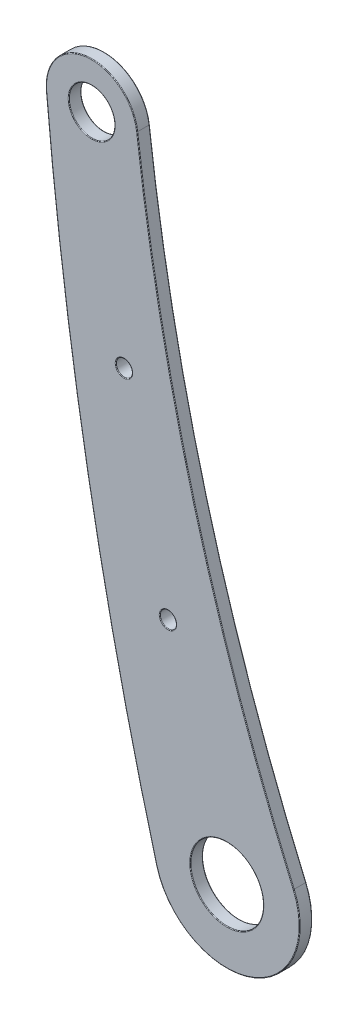
ISO-10303-21;
HEADER;
FILE_DESCRIPTION(('STEP AP214'),'2;1');
FILE_NAME('part.step','',(''),(''),'','','');
FILE_SCHEMA(('AUTOMOTIVE_DESIGN { 1 0 10303 214 1 1 1 1 }'));
ENDSEC;
DATA;
#1=APPLICATION_CONTEXT('core data for automotive mechanical design processes');
#2=APPLICATION_PROTOCOL_DEFINITION('international standard','automotive_design',2000,#1);
#3=PRODUCT_CONTEXT('',#1,'mechanical');
#4=PRODUCT('Part','Part','',(#3));
#5=PRODUCT_RELATED_PRODUCT_CATEGORY('part','',(#4));
#6=PRODUCT_DEFINITION_FORMATION('','',#4);
#7=PRODUCT_DEFINITION_CONTEXT('part definition',#1,'design');
#8=PRODUCT_DEFINITION('design','',#6,#7);
#9=PRODUCT_DEFINITION_SHAPE('','',#8);
#10=(LENGTH_UNIT() NAMED_UNIT(*) SI_UNIT(.MILLI.,.METRE.));
#11=(NAMED_UNIT(*) PLANE_ANGLE_UNIT() SI_UNIT($,.RADIAN.));
#12=(NAMED_UNIT(*) SI_UNIT($,.STERADIAN.) SOLID_ANGLE_UNIT());
#13=UNCERTAINTY_MEASURE_WITH_UNIT(LENGTH_MEASURE(1.E-05),#10,'distance_accuracy_value','');
#14=(GEOMETRIC_REPRESENTATION_CONTEXT(3) GLOBAL_UNCERTAINTY_ASSIGNED_CONTEXT((#13)) GLOBAL_UNIT_ASSIGNED_CONTEXT((#10,
#11,#12)) REPRESENTATION_CONTEXT('',''));
#15=CARTESIAN_POINT('',(0.,0.,0.));
#16=DIRECTION('',(0.,0.,1.));
#17=DIRECTION('',(1.,0.,0.));
#18=AXIS2_PLACEMENT_3D('',#15,#16,#17);
#19=CARTESIAN_POINT('',(200.988007180128,232.62825780166,3.));
#20=DIRECTION('',(0.,0.,-1.));
#21=DIRECTION('',(-1.,0.,0.));
#22=AXIS2_PLACEMENT_3D('',#19,#20,#21);
#23=PLANE('',#22);
#24=CARTESIAN_POINT('',(-34.3508040044645,105.541655290319,3.));
#25=DIRECTION('',(0.,0.,-1.));
#26=DIRECTION('',(-1.,0.,0.));
#27=AXIS2_PLACEMENT_3D('',#24,#25,#26);
#28=CIRCLE('',#27,2.09999999999999);
#29=CARTESIAN_POINT('',(-36.4508040044645,105.541655290319,3.));
#30=VERTEX_POINT('',#29);
#31=EDGE_CURVE('E11',#30,#30,#28,.T.);
#32=ORIENTED_EDGE('',*,*,#31,.T.);
#33=EDGE_LOOP('',(#32));
#34=FACE_BOUND('',#33,.T.);
#35=CARTESIAN_POINT('',(-20.22,57.58,3.));
#36=DIRECTION('',(0.,0.,-1.));
#37=DIRECTION('',(-1.,0.,0.));
#38=AXIS2_PLACEMENT_3D('',#35,#36,#37);
#39=CIRCLE('',#38,8.9);
#40=CARTESIAN_POINT('',(-29.12,57.58,3.));
#41=VERTEX_POINT('',#40);
#42=EDGE_CURVE('E42',#41,#41,#39,.T.);
#43=ORIENTED_EDGE('',*,*,#42,.T.);
#44=EDGE_LOOP('',(#43));
#45=FACE_BOUND('',#44,.T.);
#46=CARTESIAN_POINT('',(-52.6670691041316,201.979403414805,3.));
#47=DIRECTION('',(0.,0.,-1.));
#48=DIRECTION('',(-1.,0.,0.));
#49=AXIS2_PLACEMENT_3D('',#46,#47,#48);
#50=CIRCLE('',#49,5.65);
#51=CARTESIAN_POINT('',(-58.3170691041316,201.979403414805,3.));
#52=VERTEX_POINT('',#51);
#53=EDGE_CURVE('E187',#52,#52,#50,.T.);
#54=ORIENTED_EDGE('',*,*,#53,.T.);
#55=EDGE_LOOP('',(#54));
#56=FACE_BOUND('',#55,.T.);
#57=CARTESIAN_POINT('',(-20.22,57.58,3.));
#58=DIRECTION('',(0.,0.,-1.));
#59=DIRECTION('',(-1.,0.,0.));
#60=AXIS2_PLACEMENT_3D('',#57,#58,#59);
#61=CIRCLE('',#60,17.3500000000001);
#62=CARTESIAN_POINT('',(-36.960505291953,53.0217127591489,3.));
#63=VERTEX_POINT('',#62);
#64=CARTESIAN_POINT('',(-4.29946956887513,64.4763186405233,3.));
#65=VERTEX_POINT('',#64);
#66=EDGE_CURVE('E50',#63,#65,#61,.F.);
#67=ORIENTED_EDGE('',*,*,#66,.T.);
#68=CARTESIAN_POINT('',(454.643083464387,263.277112188516,3.));
#69=DIRECTION('',(0.,0.,-1.));
#70=DIRECTION('',(-1.,0.,0.));
#71=AXIS2_PLACEMENT_3D('',#68,#69,#70);
#72=CIRCLE('',#71,500.15);
#73=CARTESIAN_POINT('',(-41.8954151797315,203.280930107946,3.));
#74=VERTEX_POINT('',#73);
#75=EDGE_CURVE('E185',#65,#74,#72,.T.);
#76=ORIENTED_EDGE('',*,*,#75,.T.);
#77=CARTESIAN_POINT('',(-52.6670691041316,201.979403414805,3.));
#78=DIRECTION('',(0.,0.,-1.));
#79=DIRECTION('',(-1.,0.,0.));
#80=AXIS2_PLACEMENT_3D('',#77,#78,#79);
#81=CIRCLE('',#80,10.85);
#82=CARTESIAN_POINT('',(-63.4744173782128,201.018298174619,3.));
#83=VERTEX_POINT('',#82);
#84=EDGE_CURVE('E181',#74,#83,#81,.F.);
#85=ORIENTED_EDGE('',*,*,#84,.T.);
#86=CARTESIAN_POINT('',(783.034792827124,276.29896991403,3.));
#87=DIRECTION('',(0.,0.,-1.));
#88=DIRECTION('',(-1.,0.,0.));
#89=AXIS2_PLACEMENT_3D('',#86,#87,#88);
#90=CIRCLE('',#89,849.85);
#91=EDGE_CURVE('E55',#83,#63,#90,.F.);
#92=ORIENTED_EDGE('',*,*,#91,.T.);
#93=EDGE_LOOP('',(#67,#76,#85,#92));
#94=FACE_BOUND('',#93,.T.);
#95=CARTESIAN_POINT('',(-44.9211727354749,152.583036246298,3.));
#96=DIRECTION('',(0.,0.,-1.));
#97=DIRECTION('',(-1.,0.,0.));
#98=AXIS2_PLACEMENT_3D('',#95,#96,#97);
#99=CIRCLE('',#98,2.09999999999999);
#100=CARTESIAN_POINT('',(-47.0211727354749,152.583036246298,3.));
#101=VERTEX_POINT('',#100);
#102=EDGE_CURVE('E178',#101,#101,#99,.T.);
#103=ORIENTED_EDGE('',*,*,#102,.T.);
#104=EDGE_LOOP('',(#103));
#105=FACE_BOUND('',#104,.T.);
#106=ADVANCED_FACE('F33',(#34,#45,#56,#94,#105),#23,.F.);
#107=CARTESIAN_POINT('',(200.988007180128,232.62825780166,0.));
#108=DIRECTION('',(0.,0.,-1.));
#109=DIRECTION('',(-1.,0.,0.));
#110=AXIS2_PLACEMENT_3D('',#107,#108,#109);
#111=PLANE('',#110);
#112=CARTESIAN_POINT('',(-34.3508040044645,105.541655290319,0.));
#113=DIRECTION('',(0.,0.,-1.));
#114=DIRECTION('',(-1.,0.,0.));
#115=AXIS2_PLACEMENT_3D('',#112,#113,#114);
#116=CIRCLE('',#115,2.09999999999999);
#117=CARTESIAN_POINT('',(-36.4508040044645,105.541655290319,0.));
#118=VERTEX_POINT('',#117);
#119=EDGE_CURVE('E131',#118,#118,#116,.F.);
#120=ORIENTED_EDGE('',*,*,#119,.T.);
#121=EDGE_LOOP('',(#120));
#122=FACE_BOUND('',#121,.T.);
#123=CARTESIAN_POINT('',(-52.6670691041316,201.979403414805,0.));
#124=DIRECTION('',(0.,0.,-1.));
#125=DIRECTION('',(-1.,0.,0.));
#126=AXIS2_PLACEMENT_3D('',#123,#124,#125);
#127=CIRCLE('',#126,5.65);
#128=CARTESIAN_POINT('',(-58.3170691041316,201.979403414805,0.));
#129=VERTEX_POINT('',#128);
#130=EDGE_CURVE('E128',#129,#129,#127,.F.);
#131=ORIENTED_EDGE('',*,*,#130,.T.);
#132=EDGE_LOOP('',(#131));
#133=FACE_BOUND('',#132,.T.);
#134=CARTESIAN_POINT('',(-20.22,57.58,0.));
#135=DIRECTION('',(0.,0.,-1.));
#136=DIRECTION('',(-1.,0.,0.));
#137=AXIS2_PLACEMENT_3D('',#134,#135,#136);
#138=CIRCLE('',#137,17.3500000000001);
#139=CARTESIAN_POINT('',(-4.29946956887523,64.4763186405233,0.));
#140=VERTEX_POINT('',#139);
#141=CARTESIAN_POINT('',(-36.9605052919527,53.021712759149,0.));
#142=VERTEX_POINT('',#141);
#143=EDGE_CURVE('E127',#140,#142,#138,.T.);
#144=ORIENTED_EDGE('',*,*,#143,.T.);
#145=CARTESIAN_POINT('',(783.034792827124,276.29896991403,0.));
#146=DIRECTION('',(0.,0.,-1.));
#147=DIRECTION('',(-1.,0.,0.));
#148=AXIS2_PLACEMENT_3D('',#145,#146,#147);
#149=CIRCLE('',#148,849.85);
#150=CARTESIAN_POINT('',(-63.4744173782128,201.018298174619,0.));
#151=VERTEX_POINT('',#150);
#152=EDGE_CURVE('E105',#142,#151,#149,.T.);
#153=ORIENTED_EDGE('',*,*,#152,.T.);
#154=CARTESIAN_POINT('',(-52.6670691041316,201.979403414805,0.));
#155=DIRECTION('',(0.,0.,-1.));
#156=DIRECTION('',(-1.,0.,0.));
#157=AXIS2_PLACEMENT_3D('',#154,#155,#156);
#158=CIRCLE('',#157,10.85);
#159=CARTESIAN_POINT('',(-41.8954151797315,203.280930107946,0.));
#160=VERTEX_POINT('',#159);
#161=EDGE_CURVE('E115',#151,#160,#158,.T.);
#162=ORIENTED_EDGE('',*,*,#161,.T.);
#163=CARTESIAN_POINT('',(454.643083464387,263.277112188516,0.));
#164=DIRECTION('',(0.,0.,-1.));
#165=DIRECTION('',(-1.,0.,0.));
#166=AXIS2_PLACEMENT_3D('',#163,#164,#165);
#167=CIRCLE('',#166,500.15);
#168=EDGE_CURVE('E121',#160,#140,#167,.F.);
#169=ORIENTED_EDGE('',*,*,#168,.T.);
#170=EDGE_LOOP('',(#144,#153,#162,#169));
#171=FACE_BOUND('',#170,.T.);
#172=CARTESIAN_POINT('',(-20.22,57.58,0.));
#173=DIRECTION('',(0.,0.,-1.));
#174=DIRECTION('',(-1.,0.,0.));
#175=AXIS2_PLACEMENT_3D('',#172,#173,#174);
#176=CIRCLE('',#175,8.9);
#177=CARTESIAN_POINT('',(-29.12,57.58,0.));
#178=VERTEX_POINT('',#177);
#179=EDGE_CURVE('E122',#178,#178,#176,.F.);
#180=ORIENTED_EDGE('',*,*,#179,.T.);
#181=EDGE_LOOP('',(#180));
#182=FACE_BOUND('',#181,.T.);
#183=CARTESIAN_POINT('',(-44.9211727354749,152.583036246298,0.));
#184=DIRECTION('',(0.,0.,-1.));
#185=DIRECTION('',(-1.,0.,0.));
#186=AXIS2_PLACEMENT_3D('',#183,#184,#185);
#187=CIRCLE('',#186,2.09999999999999);
#188=CARTESIAN_POINT('',(-47.0211727354749,152.583036246298,0.));
#189=VERTEX_POINT('',#188);
#190=EDGE_CURVE('E225',#189,#189,#187,.F.);
#191=ORIENTED_EDGE('',*,*,#190,.T.);
#192=EDGE_LOOP('',(#191));
#193=FACE_BOUND('',#192,.T.);
#194=ADVANCED_FACE('F124',(#122,#133,#171,#182,#193),#111,.T.);
#195=CARTESIAN_POINT('',(-52.6670691041316,201.979403414805,3.));
#196=DIRECTION('',(0.,0.,-1.));
#197=DIRECTION('',(-1.,0.,0.));
#198=AXIS2_PLACEMENT_3D('',#195,#196,#197);
#199=CYLINDRICAL_SURFACE('',#198,11.);
#200=DIRECTION('',(0.,0.,-1.));
#201=VECTOR('',#200,1.);
#202=CARTESIAN_POINT('',(-41.7464983052007,203.298923564533,3.));
#203=LINE('',#202,#201);
#204=CARTESIAN_POINT('',(-41.7464983052007,203.298923564533,2.85));
#205=VERTEX_POINT('',#204);
#206=CARTESIAN_POINT('',(-41.7464983052007,203.298923564533,0.15));
#207=VERTEX_POINT('',#206);
#208=EDGE_CURVE('E196',#205,#207,#203,.T.);
#209=ORIENTED_EDGE('',*,*,#208,.T.);
#210=CARTESIAN_POINT('',(-52.6670691041316,201.979403414805,0.15));
#211=DIRECTION('',(0.,0.,-1.));
#212=DIRECTION('',(-1.,0.,0.));
#213=AXIS2_PLACEMENT_3D('',#210,#211,#212);
#214=CIRCLE('',#213,11.);
#215=CARTESIAN_POINT('',(-63.623827723016,201.0050110054,0.15));
#216=VERTEX_POINT('',#215);
#217=EDGE_CURVE('E164',#207,#216,#214,.F.);
#218=ORIENTED_EDGE('',*,*,#217,.T.);
#219=DIRECTION('',(0.,0.,-1.));
#220=VECTOR('',#219,1.);
#221=CARTESIAN_POINT('',(-63.623827723016,201.0050110054,3.));
#222=LINE('',#221,#220);
#223=CARTESIAN_POINT('',(-63.623827723016,201.0050110054,2.85));
#224=VERTEX_POINT('',#223);
#225=EDGE_CURVE('E218',#224,#216,#222,.T.);
#226=ORIENTED_EDGE('',*,*,#225,.F.);
#227=CARTESIAN_POINT('',(-52.6670691041316,201.979403414805,2.85));
#228=DIRECTION('',(0.,0.,-1.));
#229=DIRECTION('',(-1.,0.,0.));
#230=AXIS2_PLACEMENT_3D('',#227,#228,#229);
#231=CIRCLE('',#230,11.);
#232=EDGE_CURVE('E162',#224,#205,#231,.T.);
#233=ORIENTED_EDGE('',*,*,#232,.T.);
#234=EDGE_LOOP('',(#209,#218,#226,#233));
#235=FACE_BOUND('',#234,.T.);
#236=ADVANCED_FACE('F223',(#235),#199,.T.);
#237=CARTESIAN_POINT('',(783.034792827124,276.29896991403,3.));
#238=DIRECTION('',(0.,0.,-1.));
#239=DIRECTION('',(-1.,0.,0.));
#240=AXIS2_PLACEMENT_3D('',#237,#238,#239);
#241=CYLINDRICAL_SURFACE('',#240,850.);
#242=ORIENTED_EDGE('',*,*,#225,.T.);
#243=CARTESIAN_POINT('',(783.034792827124,276.29896991403,0.15));
#244=DIRECTION('',(0.,0.,-1.));
#245=DIRECTION('',(-1.,0.,0.));
#246=AXIS2_PLACEMENT_3D('',#243,#244,#245);
#247=CIRCLE('',#246,850.);
#248=CARTESIAN_POINT('',(-37.1052358852549,52.9823039357411,0.15));
#249=VERTEX_POINT('',#248);
#250=EDGE_CURVE('E108',#216,#249,#247,.F.);
#251=ORIENTED_EDGE('',*,*,#250,.T.);
#252=DIRECTION('',(0.,0.,-1.));
#253=VECTOR('',#252,1.);
#254=CARTESIAN_POINT('',(-37.1052358852549,52.9823039357411,3.));
#255=LINE('',#254,#253);
#256=CARTESIAN_POINT('',(-37.1052358852549,52.9823039357411,2.85));
#257=VERTEX_POINT('',#256);
#258=EDGE_CURVE('E220',#257,#249,#255,.T.);
#259=ORIENTED_EDGE('',*,*,#258,.F.);
#260=CARTESIAN_POINT('',(783.034792827124,276.29896991403,2.85));
#261=DIRECTION('',(0.,0.,-1.));
#262=DIRECTION('',(-1.,0.,0.));
#263=AXIS2_PLACEMENT_3D('',#260,#261,#262);
#264=CIRCLE('',#263,850.);
#265=EDGE_CURVE('E150',#257,#224,#264,.T.);
#266=ORIENTED_EDGE('',*,*,#265,.T.);
#267=EDGE_LOOP('',(#242,#251,#259,#266));
#268=FACE_BOUND('',#267,.T.);
#269=ADVANCED_FACE('F217',(#268),#241,.T.);
#270=CARTESIAN_POINT('',(-20.22,57.58,3.));
#271=DIRECTION('',(0.,0.,-1.));
#272=DIRECTION('',(-1.,0.,0.));
#273=AXIS2_PLACEMENT_3D('',#270,#271,#272);
#274=CYLINDRICAL_SURFACE('',#273,17.5000000000001);
#275=ORIENTED_EDGE('',*,*,#258,.T.);
#276=CARTESIAN_POINT('',(-20.22,57.58,0.15));
#277=DIRECTION('',(0.,0.,-1.));
#278=DIRECTION('',(-1.,0.,0.));
#279=AXIS2_PLACEMENT_3D('',#276,#277,#278);
#280=CIRCLE('',#279,17.5000000000001);
#281=CARTESIAN_POINT('',(-4.16182809540733,64.5359409918823,0.15));
#282=VERTEX_POINT('',#281);
#283=EDGE_CURVE('E155',#249,#282,#280,.F.);
#284=ORIENTED_EDGE('',*,*,#283,.T.);
#285=DIRECTION('',(0.,0.,-1.));
#286=VECTOR('',#285,1.);
#287=CARTESIAN_POINT('',(-4.16182809540733,64.5359409918823,3.));
#288=LINE('',#287,#286);
#289=CARTESIAN_POINT('',(-4.16182809540733,64.5359409918823,2.85));
#290=VERTEX_POINT('',#289);
#291=EDGE_CURVE('E229',#290,#282,#288,.T.);
#292=ORIENTED_EDGE('',*,*,#291,.F.);
#293=CARTESIAN_POINT('',(-20.22,57.58,2.85));
#294=DIRECTION('',(0.,0.,-1.));
#295=DIRECTION('',(-1.,0.,0.));
#296=AXIS2_PLACEMENT_3D('',#293,#294,#295);
#297=CIRCLE('',#296,17.5000000000001);
#298=EDGE_CURVE('E153',#290,#257,#297,.T.);
#299=ORIENTED_EDGE('',*,*,#298,.T.);
#300=EDGE_LOOP('',(#275,#284,#292,#299));
#301=FACE_BOUND('',#300,.T.);
#302=ADVANCED_FACE('F244',(#301),#274,.T.);
#303=CARTESIAN_POINT('',(454.643083464387,263.277112188516,3.));
#304=DIRECTION('',(0.,0.,-1.));
#305=DIRECTION('',(-1.,0.,0.));
#306=AXIS2_PLACEMENT_3D('',#303,#304,#305);
#307=CYLINDRICAL_SURFACE('',#306,500.);
#308=ORIENTED_EDGE('',*,*,#291,.T.);
#309=CARTESIAN_POINT('',(454.643083464387,263.277112188516,0.15));
#310=DIRECTION('',(0.,0.,-1.));
#311=DIRECTION('',(-1.,0.,0.));
#312=AXIS2_PLACEMENT_3D('',#309,#310,#311);
#313=CIRCLE('',#312,500.);
#314=EDGE_CURVE('E160',#282,#207,#313,.T.);
#315=ORIENTED_EDGE('',*,*,#314,.T.);
#316=ORIENTED_EDGE('',*,*,#208,.F.);
#317=CARTESIAN_POINT('',(454.643083464387,263.277112188516,2.85));
#318=DIRECTION('',(0.,0.,-1.));
#319=DIRECTION('',(-1.,0.,0.));
#320=AXIS2_PLACEMENT_3D('',#317,#318,#319);
#321=CIRCLE('',#320,500.);
#322=EDGE_CURVE('E157',#205,#290,#321,.F.);
#323=ORIENTED_EDGE('',*,*,#322,.T.);
#324=EDGE_LOOP('',(#308,#315,#316,#323));
#325=FACE_BOUND('',#324,.T.);
#326=ADVANCED_FACE('F248',(#325),#307,.F.);
#327=CARTESIAN_POINT('',(-52.6670691041316,201.979403414805,3.));
#328=DIRECTION('',(0.,0.,-1.));
#329=DIRECTION('',(-1.,0.,0.));
#330=AXIS2_PLACEMENT_3D('',#327,#328,#329);
#331=CYLINDRICAL_SURFACE('',#330,5.5);
#332=CARTESIAN_POINT('',(-52.6670691041316,201.979403414805,0.15));
#333=DIRECTION('',(0.,0.,-1.));
#334=DIRECTION('',(-1.,0.,0.));
#335=AXIS2_PLACEMENT_3D('',#332,#333,#334);
#336=CIRCLE('',#335,5.5);
#337=CARTESIAN_POINT('',(-58.1670691041316,201.979403414805,0.15));
#338=VERTEX_POINT('',#337);
#339=EDGE_CURVE('E147',#338,#338,#336,.T.);
#340=ORIENTED_EDGE('',*,*,#339,.T.);
#341=EDGE_LOOP('',(#340));
#342=FACE_BOUND('',#341,.T.);
#343=CARTESIAN_POINT('',(-52.6670691041316,201.979403414805,2.85));
#344=DIRECTION('',(0.,0.,-1.));
#345=DIRECTION('',(-1.,0.,0.));
#346=AXIS2_PLACEMENT_3D('',#343,#344,#345);
#347=CIRCLE('',#346,5.5);
#348=CARTESIAN_POINT('',(-58.1670691041316,201.979403414805,2.85));
#349=VERTEX_POINT('',#348);
#350=EDGE_CURVE('E144',#349,#349,#347,.F.);
#351=ORIENTED_EDGE('',*,*,#350,.T.);
#352=EDGE_LOOP('',(#351));
#353=FACE_BOUND('',#352,.T.);
#354=ADVANCED_FACE('F283',(#342,#353),#331,.F.);
#355=CARTESIAN_POINT('',(-20.22,57.58,3.));
#356=DIRECTION('',(0.,0.,-1.));
#357=DIRECTION('',(-1.,0.,0.));
#358=AXIS2_PLACEMENT_3D('',#355,#356,#357);
#359=CYLINDRICAL_SURFACE('',#358,8.75);
#360=CARTESIAN_POINT('',(-20.22,57.58,0.15));
#361=DIRECTION('',(0.,0.,-1.));
#362=DIRECTION('',(-1.,0.,0.));
#363=AXIS2_PLACEMENT_3D('',#360,#361,#362);
#364=CIRCLE('',#363,8.75);
#365=CARTESIAN_POINT('',(-28.97,57.58,0.15));
#366=VERTEX_POINT('',#365);
#367=EDGE_CURVE('E169',#366,#366,#364,.T.);
#368=ORIENTED_EDGE('',*,*,#367,.T.);
#369=EDGE_LOOP('',(#368));
#370=FACE_BOUND('',#369,.T.);
#371=CARTESIAN_POINT('',(-20.22,57.58,2.85));
#372=DIRECTION('',(0.,0.,-1.));
#373=DIRECTION('',(-1.,0.,0.));
#374=AXIS2_PLACEMENT_3D('',#371,#372,#373);
#375=CIRCLE('',#374,8.75);
#376=CARTESIAN_POINT('',(-28.97,57.58,2.85));
#377=VERTEX_POINT('',#376);
#378=EDGE_CURVE('E166',#377,#377,#375,.F.);
#379=ORIENTED_EDGE('',*,*,#378,.T.);
#380=EDGE_LOOP('',(#379));
#381=FACE_BOUND('',#380,.T.);
#382=ADVANCED_FACE('F277',(#370,#381),#359,.F.);
#383=CARTESIAN_POINT('',(-34.3508040044645,105.541655290319,3.));
#384=DIRECTION('',(0.,0.,1.));
#385=DIRECTION('',(1.,0.,0.));
#386=AXIS2_PLACEMENT_3D('',#383,#384,#385);
#387=CYLINDRICAL_SURFACE('',#386,1.94999999999999);
#388=CARTESIAN_POINT('',(-34.3508040044645,105.541655290319,0.15));
#389=DIRECTION('',(0.,0.,-1.));
#390=DIRECTION('',(-1.,0.,0.));
#391=AXIS2_PLACEMENT_3D('',#388,#389,#390);
#392=CIRCLE('',#391,1.94999999999999);
#393=CARTESIAN_POINT('',(-36.3008040044645,105.541655290319,0.15));
#394=VERTEX_POINT('',#393);
#395=EDGE_CURVE('E141',#394,#394,#392,.T.);
#396=ORIENTED_EDGE('',*,*,#395,.T.);
#397=EDGE_LOOP('',(#396));
#398=FACE_BOUND('',#397,.T.);
#399=CARTESIAN_POINT('',(-34.3508040044645,105.541655290319,2.85));
#400=DIRECTION('',(0.,0.,-1.));
#401=DIRECTION('',(-1.,0.,0.));
#402=AXIS2_PLACEMENT_3D('',#399,#400,#401);
#403=CIRCLE('',#402,1.94999999999999);
#404=CARTESIAN_POINT('',(-36.3008040044645,105.541655290319,2.85));
#405=VERTEX_POINT('',#404);
#406=EDGE_CURVE('E138',#405,#405,#403,.F.);
#407=ORIENTED_EDGE('',*,*,#406,.T.);
#408=EDGE_LOOP('',(#407));
#409=FACE_BOUND('',#408,.T.);
#410=ADVANCED_FACE('F267',(#398,#409),#387,.F.);
#411=CARTESIAN_POINT('',(-44.9211727354749,152.583036246298,3.));
#412=DIRECTION('',(0.,0.,1.));
#413=DIRECTION('',(1.,0.,0.));
#414=AXIS2_PLACEMENT_3D('',#411,#412,#413);
#415=CYLINDRICAL_SURFACE('',#414,1.94999999999999);
#416=CARTESIAN_POINT('',(-44.9211727354749,152.583036246298,0.15));
#417=DIRECTION('',(0.,0.,-1.));
#418=DIRECTION('',(-1.,0.,0.));
#419=AXIS2_PLACEMENT_3D('',#416,#417,#418);
#420=CIRCLE('',#419,1.94999999999999);
#421=CARTESIAN_POINT('',(-46.8711727354749,152.583036246298,0.15));
#422=VERTEX_POINT('',#421);
#423=EDGE_CURVE('E175',#422,#422,#420,.T.);
#424=ORIENTED_EDGE('',*,*,#423,.T.);
#425=EDGE_LOOP('',(#424));
#426=FACE_BOUND('',#425,.T.);
#427=CARTESIAN_POINT('',(-44.9211727354749,152.583036246298,2.85));
#428=DIRECTION('',(0.,0.,-1.));
#429=DIRECTION('',(-1.,0.,0.));
#430=AXIS2_PLACEMENT_3D('',#427,#428,#429);
#431=CIRCLE('',#430,1.94999999999999);
#432=CARTESIAN_POINT('',(-46.8711727354749,152.583036246298,2.85));
#433=VERTEX_POINT('',#432);
#434=EDGE_CURVE('E172',#433,#433,#431,.F.);
#435=ORIENTED_EDGE('',*,*,#434,.T.);
#436=EDGE_LOOP('',(#435));
#437=FACE_BOUND('',#436,.T.);
#438=ADVANCED_FACE('F264',(#426,#437),#415,.F.);
#439=CARTESIAN_POINT('',(-34.3508040044645,105.541655290319,0.15));
#440=DIRECTION('',(0.,0.,-1.));
#441=DIRECTION('',(-1.,0.,0.));
#442=AXIS2_PLACEMENT_3D('',#439,#440,#441);
#443=TOROIDAL_SURFACE('',#442,2.09999999999999,0.15);
#444=ORIENTED_EDGE('',*,*,#395,.F.);
#445=EDGE_LOOP('',(#444));
#446=FACE_BOUND('',#445,.T.);
#447=ORIENTED_EDGE('',*,*,#119,.F.);
#448=EDGE_LOOP('',(#447));
#449=FACE_BOUND('',#448,.T.);
#450=ADVANCED_FACE('F266',(#446,#449),#443,.T.);
#451=CARTESIAN_POINT('',(-52.6670691041316,201.979403414805,0.15));
#452=DIRECTION('',(0.,0.,-1.));
#453=DIRECTION('',(-1.,0.,0.));
#454=AXIS2_PLACEMENT_3D('',#451,#452,#453);
#455=TOROIDAL_SURFACE('',#454,5.65,0.15);
#456=ORIENTED_EDGE('',*,*,#339,.F.);
#457=EDGE_LOOP('',(#456));
#458=FACE_BOUND('',#457,.T.);
#459=ORIENTED_EDGE('',*,*,#130,.F.);
#460=EDGE_LOOP('',(#459));
#461=FACE_BOUND('',#460,.T.);
#462=ADVANCED_FACE('F274',(#458,#461),#455,.T.);
#463=CARTESIAN_POINT('',(454.643083464387,263.277112188516,0.15));
#464=DIRECTION('',(0.,0.,-1.));
#465=DIRECTION('',(-1.,0.,0.));
#466=AXIS2_PLACEMENT_3D('',#463,#464,#465);
#467=TOROIDAL_SURFACE('',#466,500.15,0.15);
#468=CARTESIAN_POINT('',(-4.29946956887523,64.4763186405233,0.15));
#469=DIRECTION('',(0.397482342393292,-0.917609823119577,0.));
#470=DIRECTION('',(0.917609823119577,0.397482342393292,0.));
#471=AXIS2_PLACEMENT_3D('',#468,#469,#470);
#472=CIRCLE('',#471,0.15);
#473=EDGE_CURVE('E111',#140,#282,#472,.T.);
#474=ORIENTED_EDGE('',*,*,#473,.F.);
#475=ORIENTED_EDGE('',*,*,#168,.F.);
#476=CARTESIAN_POINT('',(-41.8954151797315,203.280930107946,0.15));
#477=DIRECTION('',(-0.119956377248041,0.992779163539166,0.));
#478=DIRECTION('',(-0.992779163539166,-0.119956377248041,0.));
#479=AXIS2_PLACEMENT_3D('',#476,#477,#478);
#480=CIRCLE('',#479,0.15);
#481=EDGE_CURVE('E118',#207,#160,#480,.T.);
#482=ORIENTED_EDGE('',*,*,#481,.F.);
#483=ORIENTED_EDGE('',*,*,#314,.F.);
#484=EDGE_LOOP('',(#474,#475,#482,#483));
#485=FACE_BOUND('',#484,.T.);
#486=ADVANCED_FACE('F237',(#485),#467,.T.);
#487=CARTESIAN_POINT('',(-52.6670691041316,201.979403414805,0.15));
#488=DIRECTION('',(0.,0.,-1.));
#489=DIRECTION('',(-1.,0.,0.));
#490=AXIS2_PLACEMENT_3D('',#487,#488,#489);
#491=TOROIDAL_SURFACE('',#490,10.85,0.15);
#492=ORIENTED_EDGE('',*,*,#481,.T.);
#493=ORIENTED_EDGE('',*,*,#161,.F.);
#494=CARTESIAN_POINT('',(-63.4744173782128,201.018298174619,0.15));
#495=DIRECTION('',(0.0885811281277809,-0.996068965353107,0.));
#496=DIRECTION('',(0.996068965353107,0.0885811281277809,0.));
#497=AXIS2_PLACEMENT_3D('',#494,#495,#496);
#498=CIRCLE('',#497,0.15);
#499=EDGE_CURVE('E101',#216,#151,#498,.T.);
#500=ORIENTED_EDGE('',*,*,#499,.F.);
#501=ORIENTED_EDGE('',*,*,#217,.F.);
#502=EDGE_LOOP('',(#492,#493,#500,#501));
#503=FACE_BOUND('',#502,.T.);
#504=ADVANCED_FACE('F116',(#503),#491,.T.);
#505=CARTESIAN_POINT('',(-20.22,57.58,0.15));
#506=DIRECTION('',(0.,0.,-1.));
#507=DIRECTION('',(-1.,0.,0.));
#508=AXIS2_PLACEMENT_3D('',#505,#506,#507);
#509=TOROIDAL_SURFACE('',#508,17.3500000000001,0.15);
#510=ORIENTED_EDGE('',*,*,#473,.T.);
#511=ORIENTED_EDGE('',*,*,#283,.F.);
#512=CARTESIAN_POINT('',(-36.9605052919527,53.021712759149,0.15));
#513=DIRECTION('',(-0.262725489386207,0.964870622014568,0.));
#514=DIRECTION('',(-0.964870622014568,-0.262725489386207,0.));
#515=AXIS2_PLACEMENT_3D('',#512,#513,#514);
#516=CIRCLE('',#515,0.15);
#517=EDGE_CURVE('E112',#142,#249,#516,.T.);
#518=ORIENTED_EDGE('',*,*,#517,.F.);
#519=ORIENTED_EDGE('',*,*,#143,.F.);
#520=EDGE_LOOP('',(#510,#511,#518,#519));
#521=FACE_BOUND('',#520,.T.);
#522=ADVANCED_FACE('F240',(#521),#509,.T.);
#523=CARTESIAN_POINT('',(783.034792827124,276.29896991403,0.15));
#524=DIRECTION('',(0.,0.,-1.));
#525=DIRECTION('',(-1.,0.,0.));
#526=AXIS2_PLACEMENT_3D('',#523,#524,#525);
#527=TOROIDAL_SURFACE('',#526,849.85,0.15);
#528=ORIENTED_EDGE('',*,*,#499,.T.);
#529=ORIENTED_EDGE('',*,*,#152,.F.);
#530=ORIENTED_EDGE('',*,*,#517,.T.);
#531=ORIENTED_EDGE('',*,*,#250,.F.);
#532=EDGE_LOOP('',(#528,#529,#530,#531));
#533=FACE_BOUND('',#532,.T.);
#534=ADVANCED_FACE('F103',(#533),#527,.T.);
#535=CARTESIAN_POINT('',(-20.22,57.58,0.15));
#536=DIRECTION('',(0.,0.,-1.));
#537=DIRECTION('',(-1.,0.,0.));
#538=AXIS2_PLACEMENT_3D('',#535,#536,#537);
#539=TOROIDAL_SURFACE('',#538,8.9,0.15);
#540=ORIENTED_EDGE('',*,*,#367,.F.);
#541=EDGE_LOOP('',(#540));
#542=FACE_BOUND('',#541,.T.);
#543=ORIENTED_EDGE('',*,*,#179,.F.);
#544=EDGE_LOOP('',(#543));
#545=FACE_BOUND('',#544,.T.);
#546=ADVANCED_FACE('F304',(#542,#545),#539,.T.);
#547=CARTESIAN_POINT('',(-44.9211727354749,152.583036246298,0.15));
#548=DIRECTION('',(0.,0.,-1.));
#549=DIRECTION('',(-1.,0.,0.));
#550=AXIS2_PLACEMENT_3D('',#547,#548,#549);
#551=TOROIDAL_SURFACE('',#550,2.09999999999999,0.15);
#552=ORIENTED_EDGE('',*,*,#423,.F.);
#553=EDGE_LOOP('',(#552));
#554=FACE_BOUND('',#553,.T.);
#555=ORIENTED_EDGE('',*,*,#190,.F.);
#556=EDGE_LOOP('',(#555));
#557=FACE_BOUND('',#556,.T.);
#558=ADVANCED_FACE('F313',(#554,#557),#551,.T.);
#559=CARTESIAN_POINT('',(-34.3508040044645,105.541655290319,2.85));
#560=DIRECTION('',(0.,0.,-1.));
#561=DIRECTION('',(-1.,0.,0.));
#562=AXIS2_PLACEMENT_3D('',#559,#560,#561);
#563=TOROIDAL_SURFACE('',#562,2.09999999999999,0.15);
#564=ORIENTED_EDGE('',*,*,#31,.F.);
#565=EDGE_LOOP('',(#564));
#566=FACE_BOUND('',#565,.T.);
#567=ORIENTED_EDGE('',*,*,#406,.F.);
#568=EDGE_LOOP('',(#567));
#569=FACE_BOUND('',#568,.T.);
#570=ADVANCED_FACE('F317',(#566,#569),#563,.T.);
#571=CARTESIAN_POINT('',(-20.22,57.58,2.85));
#572=DIRECTION('',(0.,0.,-1.));
#573=DIRECTION('',(-1.,0.,0.));
#574=AXIS2_PLACEMENT_3D('',#571,#572,#573);
#575=TOROIDAL_SURFACE('',#574,8.9,0.15);
#576=ORIENTED_EDGE('',*,*,#42,.F.);
#577=EDGE_LOOP('',(#576));
#578=FACE_BOUND('',#577,.T.);
#579=ORIENTED_EDGE('',*,*,#378,.F.);
#580=EDGE_LOOP('',(#579));
#581=FACE_BOUND('',#580,.T.);
#582=ADVANCED_FACE('F321',(#578,#581),#575,.T.);
#583=CARTESIAN_POINT('',(-52.6670691041316,201.979403414805,2.85));
#584=DIRECTION('',(0.,0.,-1.));
#585=DIRECTION('',(-1.,0.,0.));
#586=AXIS2_PLACEMENT_3D('',#583,#584,#585);
#587=TOROIDAL_SURFACE('',#586,5.65,0.15);
#588=ORIENTED_EDGE('',*,*,#53,.F.);
#589=EDGE_LOOP('',(#588));
#590=FACE_BOUND('',#589,.T.);
#591=ORIENTED_EDGE('',*,*,#350,.F.);
#592=EDGE_LOOP('',(#591));
#593=FACE_BOUND('',#592,.T.);
#594=ADVANCED_FACE('F325',(#590,#593),#587,.T.);
#595=CARTESIAN_POINT('',(783.034792827124,276.29896991403,2.85));
#596=DIRECTION('',(0.,0.,-1.));
#597=DIRECTION('',(-1.,0.,0.));
#598=AXIS2_PLACEMENT_3D('',#595,#596,#597);
#599=TOROIDAL_SURFACE('',#598,849.85,0.15);
#600=CARTESIAN_POINT('',(-63.474417378213,201.018298174619,2.85));
#601=DIRECTION('',(-0.0885811281277809,0.996068965353107,0.));
#602=DIRECTION('',(-0.996068965353107,-0.0885811281277809,0.));
#603=AXIS2_PLACEMENT_3D('',#600,#601,#602);
#604=CIRCLE('',#603,0.15);
#605=EDGE_CURVE('E200',#224,#83,#604,.T.);
#606=ORIENTED_EDGE('',*,*,#605,.F.);
#607=ORIENTED_EDGE('',*,*,#265,.F.);
#608=CARTESIAN_POINT('',(-36.960505291953,53.0217127591489,2.85));
#609=DIRECTION('',(0.262725489386269,-0.964870622014551,0.));
#610=DIRECTION('',(0.964870622014551,0.262725489386269,0.));
#611=AXIS2_PLACEMENT_3D('',#608,#609,#610);
#612=CIRCLE('',#611,0.15);
#613=EDGE_CURVE('E37',#63,#257,#612,.T.);
#614=ORIENTED_EDGE('',*,*,#613,.F.);
#615=ORIENTED_EDGE('',*,*,#91,.F.);
#616=EDGE_LOOP('',(#606,#607,#614,#615));
#617=FACE_BOUND('',#616,.T.);
#618=ADVANCED_FACE('F212',(#617),#599,.T.);
#619=CARTESIAN_POINT('',(-20.22,57.58,2.85));
#620=DIRECTION('',(0.,0.,-1.));
#621=DIRECTION('',(-1.,0.,0.));
#622=AXIS2_PLACEMENT_3D('',#619,#620,#621);
#623=TOROIDAL_SURFACE('',#622,17.3500000000001,0.15);
#624=ORIENTED_EDGE('',*,*,#613,.T.);
#625=ORIENTED_EDGE('',*,*,#298,.F.);
#626=CARTESIAN_POINT('',(-4.29946956887513,64.4763186405233,2.85));
#627=DIRECTION('',(-0.397482342393288,0.917609823119579,0.));
#628=DIRECTION('',(-0.917609823119579,-0.397482342393288,0.));
#629=AXIS2_PLACEMENT_3D('',#626,#627,#628);
#630=CIRCLE('',#629,0.15);
#631=EDGE_CURVE('E199',#65,#290,#630,.T.);
#632=ORIENTED_EDGE('',*,*,#631,.F.);
#633=ORIENTED_EDGE('',*,*,#66,.F.);
#634=EDGE_LOOP('',(#624,#625,#632,#633));
#635=FACE_BOUND('',#634,.T.);
#636=ADVANCED_FACE('F209',(#635),#623,.T.);
#637=CARTESIAN_POINT('',(-52.6670691041316,201.979403414805,2.85));
#638=DIRECTION('',(0.,0.,-1.));
#639=DIRECTION('',(-1.,0.,0.));
#640=AXIS2_PLACEMENT_3D('',#637,#638,#639);
#641=TOROIDAL_SURFACE('',#640,10.85,0.15);
#642=ORIENTED_EDGE('',*,*,#605,.T.);
#643=ORIENTED_EDGE('',*,*,#84,.F.);
#644=CARTESIAN_POINT('',(-41.8954151797315,203.280930107946,2.85));
#645=DIRECTION('',(0.119956377248041,-0.992779163539166,0.));
#646=DIRECTION('',(0.992779163539166,0.119956377248041,0.));
#647=AXIS2_PLACEMENT_3D('',#644,#645,#646);
#648=CIRCLE('',#647,0.15);
#649=EDGE_CURVE('E197',#205,#74,#648,.T.);
#650=ORIENTED_EDGE('',*,*,#649,.F.);
#651=ORIENTED_EDGE('',*,*,#232,.F.);
#652=EDGE_LOOP('',(#642,#643,#650,#651));
#653=FACE_BOUND('',#652,.T.);
#654=ADVANCED_FACE('F253',(#653),#641,.T.);
#655=CARTESIAN_POINT('',(454.643083464387,263.277112188516,2.85));
#656=DIRECTION('',(0.,0.,-1.));
#657=DIRECTION('',(-1.,0.,0.));
#658=AXIS2_PLACEMENT_3D('',#655,#656,#657);
#659=TOROIDAL_SURFACE('',#658,500.15,0.15);
#660=ORIENTED_EDGE('',*,*,#631,.T.);
#661=ORIENTED_EDGE('',*,*,#322,.F.);
#662=ORIENTED_EDGE('',*,*,#649,.T.);
#663=ORIENTED_EDGE('',*,*,#75,.F.);
#664=EDGE_LOOP('',(#660,#661,#662,#663));
#665=FACE_BOUND('',#664,.T.);
#666=ADVANCED_FACE('F251',(#665),#659,.T.);
#667=CARTESIAN_POINT('',(-44.9211727354749,152.583036246298,2.85));
#668=DIRECTION('',(0.,0.,-1.));
#669=DIRECTION('',(-1.,0.,0.));
#670=AXIS2_PLACEMENT_3D('',#667,#668,#669);
#671=TOROIDAL_SURFACE('',#670,2.09999999999999,0.15);
#672=ORIENTED_EDGE('',*,*,#102,.F.);
#673=EDGE_LOOP('',(#672));
#674=FACE_BOUND('',#673,.T.);
#675=ORIENTED_EDGE('',*,*,#434,.F.);
#676=EDGE_LOOP('',(#675));
#677=FACE_BOUND('',#676,.T.);
#678=ADVANCED_FACE('F35',(#674,#677),#671,.T.);
#679=CLOSED_SHELL('',(#106,#194,#236,#269,#302,#326,#354,#382,#410,#438,#450,#462,#486,#504,
#522,#534,#546,#558,#570,#582,#594,#618,#636,#654,#666,#678));
#680=MANIFOLD_SOLID_BREP('B2',#679);
#681=ADVANCED_BREP_SHAPE_REPRESENTATION('',(#18,#680),#14);
#682=SHAPE_DEFINITION_REPRESENTATION(#9,#681);
ENDSEC;
END-ISO-10303-21;
